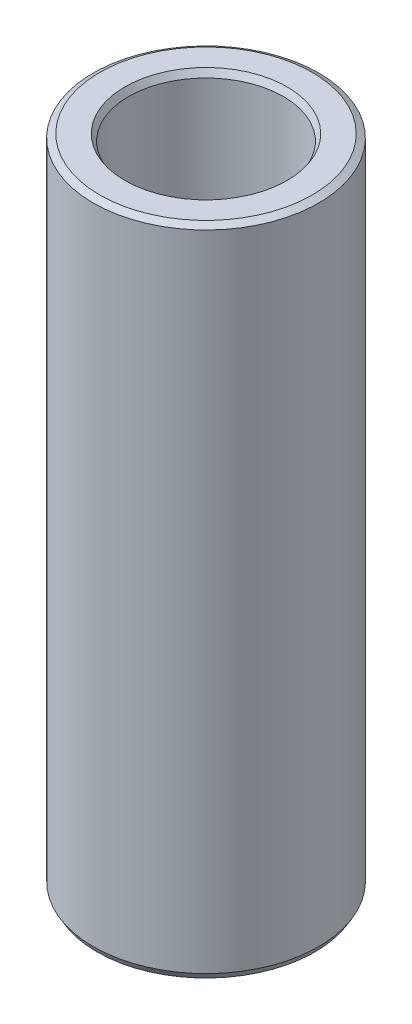
ISO-10303-21;
HEADER;
FILE_DESCRIPTION(('STEP AP214'),'2;1');
FILE_NAME('part.step','',(''),(''),'','','');
FILE_SCHEMA(('AUTOMOTIVE_DESIGN { 1 0 10303 214 1 1 1 1 }'));
ENDSEC;
DATA;
#1=APPLICATION_CONTEXT('core data for automotive mechanical design processes');
#2=APPLICATION_PROTOCOL_DEFINITION('international standard','automotive_design',2000,#1);
#3=PRODUCT_CONTEXT('',#1,'mechanical');
#4=PRODUCT('Part','Part','',(#3));
#5=PRODUCT_RELATED_PRODUCT_CATEGORY('part','',(#4));
#6=PRODUCT_DEFINITION_FORMATION('','',#4);
#7=PRODUCT_DEFINITION_CONTEXT('part definition',#1,'design');
#8=PRODUCT_DEFINITION('design','',#6,#7);
#9=PRODUCT_DEFINITION_SHAPE('','',#8);
#10=(LENGTH_UNIT() NAMED_UNIT(*) SI_UNIT(.MILLI.,.METRE.));
#11=(NAMED_UNIT(*) PLANE_ANGLE_UNIT() SI_UNIT($,.RADIAN.));
#12=(NAMED_UNIT(*) SI_UNIT($,.STERADIAN.) SOLID_ANGLE_UNIT());
#13=UNCERTAINTY_MEASURE_WITH_UNIT(LENGTH_MEASURE(1.E-05),#10,'distance_accuracy_value','');
#14=(GEOMETRIC_REPRESENTATION_CONTEXT(3) GLOBAL_UNCERTAINTY_ASSIGNED_CONTEXT((#13)) GLOBAL_UNIT_ASSIGNED_CONTEXT((#10,
#11,#12)) REPRESENTATION_CONTEXT('',''));
#15=CARTESIAN_POINT('',(0.,0.,0.));
#16=DIRECTION('',(0.,0.,1.));
#17=DIRECTION('',(1.,0.,0.));
#18=AXIS2_PLACEMENT_3D('',#15,#16,#17);
#19=CARTESIAN_POINT('',(0.,43.5333824528574,0.));
#20=DIRECTION('',(0.,-1.,0.));
#21=DIRECTION('',(0.,0.,-1.));
#22=AXIS2_PLACEMENT_3D('',#19,#20,#21);
#23=CYLINDRICAL_SURFACE('',#22,7.5);
#24=CARTESIAN_POINT('',(0.,0.430787770580185,0.));
#25=DIRECTION('',(0.,1.,0.));
#26=DIRECTION('',(0.,0.,1.));
#27=AXIS2_PLACEMENT_3D('',#24,#25,#26);
#28=CIRCLE('',#27,7.5);
#29=CARTESIAN_POINT('',(0.,0.430787770580185,7.5));
#30=VERTEX_POINT('',#29);
#31=EDGE_CURVE('E10',#30,#30,#28,.T.);
#32=ORIENTED_EDGE('',*,*,#31,.T.);
#33=EDGE_LOOP('',(#32));
#34=FACE_BOUND('',#33,.T.);
#35=CARTESIAN_POINT('',(0.,43.2846670175493,0.));
#36=DIRECTION('',(0.,1.,0.));
#37=DIRECTION('',(0.,0.,1.));
#38=AXIS2_PLACEMENT_3D('',#35,#36,#37);
#39=CIRCLE('',#38,7.5);
#40=CARTESIAN_POINT('',(0.,43.2846670175493,7.5));
#41=VERTEX_POINT('',#40);
#42=EDGE_CURVE('E50',#41,#41,#39,.F.);
#43=ORIENTED_EDGE('',*,*,#42,.T.);
#44=EDGE_LOOP('',(#43));
#45=FACE_BOUND('',#44,.T.);
#46=ADVANCED_FACE('F39',(#34,#45),#23,.T.);
#47=CARTESIAN_POINT('',(0.,43.5333824528574,0.));
#48=DIRECTION('',(0.,1.,0.));
#49=DIRECTION('',(0.,0.,1.));
#50=AXIS2_PLACEMENT_3D('',#47,#48,#49);
#51=PLANE('',#50);
#52=CARTESIAN_POINT('',(0.,43.5333824528574,0.));
#53=DIRECTION('',(0.,1.,0.));
#54=DIRECTION('',(0.,0.,1.));
#55=AXIS2_PLACEMENT_3D('',#52,#53,#54);
#56=CIRCLE('',#55,5.39903695434205);
#57=CARTESIAN_POINT('',(0.,43.5333824528574,5.39903695434205));
#58=VERTEX_POINT('',#57);
#59=EDGE_CURVE('E58',#58,#58,#56,.F.);
#60=ORIENTED_EDGE('',*,*,#59,.T.);
#61=EDGE_LOOP('',(#60));
#62=FACE_BOUND('',#61,.T.);
#63=CARTESIAN_POINT('',(0.,43.5333824528574,0.));
#64=DIRECTION('',(0.,1.,0.));
#65=DIRECTION('',(0.,0.,1.));
#66=AXIS2_PLACEMENT_3D('',#63,#64,#65);
#67=CIRCLE('',#66,7.06921222941979);
#68=CARTESIAN_POINT('',(0.,43.5333824528574,7.06921222941979));
#69=VERTEX_POINT('',#68);
#70=EDGE_CURVE('E61',#69,#69,#67,.T.);
#71=ORIENTED_EDGE('',*,*,#70,.T.);
#72=EDGE_LOOP('',(#71));
#73=FACE_BOUND('',#72,.T.);
#74=ADVANCED_FACE('F88',(#62,#73),#51,.T.);
#75=CARTESIAN_POINT('',(0.,0.,0.));
#76=DIRECTION('',(0.,1.,0.));
#77=DIRECTION('',(0.,0.,1.));
#78=AXIS2_PLACEMENT_3D('',#75,#76,#77);
#79=PLANE('',#78);
#80=CARTESIAN_POINT('',(0.,0.,0.));
#81=DIRECTION('',(0.,1.,0.));
#82=DIRECTION('',(0.,0.,1.));
#83=AXIS2_PLACEMENT_3D('',#80,#81,#82);
#84=CIRCLE('',#83,5.58110928961417);
#85=CARTESIAN_POINT('',(0.,0.,5.58110928961417));
#86=VERTEX_POINT('',#85);
#87=EDGE_CURVE('E51',#86,#86,#84,.T.);
#88=ORIENTED_EDGE('',*,*,#87,.T.);
#89=EDGE_LOOP('',(#88));
#90=FACE_BOUND('',#89,.T.);
#91=CARTESIAN_POINT('',(0.,0.,0.));
#92=DIRECTION('',(0.,1.,0.));
#93=DIRECTION('',(0.,0.,1.));
#94=AXIS2_PLACEMENT_3D('',#91,#92,#93);
#95=CIRCLE('',#94,7.25128456469193);
#96=CARTESIAN_POINT('',(0.,0.,7.25128456469193));
#97=VERTEX_POINT('',#96);
#98=EDGE_CURVE('E54',#97,#97,#95,.F.);
#99=ORIENTED_EDGE('',*,*,#98,.T.);
#100=EDGE_LOOP('',(#99));
#101=FACE_BOUND('',#100,.T.);
#102=ADVANCED_FACE('F83',(#90,#101),#79,.F.);
#103=CARTESIAN_POINT('',(0.,43.5333824528574,0.));
#104=DIRECTION('',(0.,-1.,0.));
#105=DIRECTION('',(0.,0.,-1.));
#106=AXIS2_PLACEMENT_3D('',#103,#104,#105);
#107=CYLINDRICAL_SURFACE('',#106,5.15032151903396);
#108=CARTESIAN_POINT('',(0.,43.1025946822772,0.));
#109=DIRECTION('',(0.,1.,0.));
#110=DIRECTION('',(0.,0.,1.));
#111=AXIS2_PLACEMENT_3D('',#108,#109,#110);
#112=CIRCLE('',#111,5.15032151903396);
#113=CARTESIAN_POINT('',(0.,43.1025946822772,5.15032151903396));
#114=VERTEX_POINT('',#113);
#115=EDGE_CURVE('E67',#114,#114,#112,.T.);
#116=ORIENTED_EDGE('',*,*,#115,.T.);
#117=EDGE_LOOP('',(#116));
#118=FACE_BOUND('',#117,.T.);
#119=CARTESIAN_POINT('',(0.,0.248715435308085,0.));
#120=DIRECTION('',(0.,1.,0.));
#121=DIRECTION('',(0.,0.,1.));
#122=AXIS2_PLACEMENT_3D('',#119,#120,#121);
#123=CIRCLE('',#122,5.15032151903396);
#124=CARTESIAN_POINT('',(0.,0.248715435308085,5.15032151903396));
#125=VERTEX_POINT('',#124);
#126=EDGE_CURVE('E69',#125,#125,#123,.F.);
#127=ORIENTED_EDGE('',*,*,#126,.T.);
#128=EDGE_LOOP('',(#127));
#129=FACE_BOUND('',#128,.T.);
#130=ADVANCED_FACE('F71',(#118,#129),#107,.F.);
#131=CARTESIAN_POINT('',(0.,43.1025946822772,0.));
#132=DIRECTION('',(0.,1.,0.));
#133=DIRECTION('',(0.,0.,1.));
#134=AXIS2_PLACEMENT_3D('',#131,#132,#133);
#135=CONICAL_SURFACE('',#134,5.15032151903396,0.523598775598299);
#136=ORIENTED_EDGE('',*,*,#59,.F.);
#137=EDGE_LOOP('',(#136));
#138=FACE_BOUND('',#137,.T.);
#139=ORIENTED_EDGE('',*,*,#115,.F.);
#140=EDGE_LOOP('',(#139));
#141=FACE_BOUND('',#140,.T.);
#142=ADVANCED_FACE('F77',(#138,#141),#135,.F.);
#143=CARTESIAN_POINT('',(0.,0.,0.));
#144=DIRECTION('',(0.,-1.,0.));
#145=DIRECTION('',(0.,0.,-1.));
#146=AXIS2_PLACEMENT_3D('',#143,#144,#145);
#147=CONICAL_SURFACE('',#146,5.58110928961417,1.04719755119659);
#148=ORIENTED_EDGE('',*,*,#126,.F.);
#149=EDGE_LOOP('',(#148));
#150=FACE_BOUND('',#149,.T.);
#151=ORIENTED_EDGE('',*,*,#87,.F.);
#152=EDGE_LOOP('',(#151));
#153=FACE_BOUND('',#152,.T.);
#154=ADVANCED_FACE('F73',(#150,#153),#147,.F.);
#155=CARTESIAN_POINT('',(0.,0.430787770580185,0.));
#156=DIRECTION('',(0.,1.,0.));
#157=DIRECTION('',(0.,0.,1.));
#158=AXIS2_PLACEMENT_3D('',#155,#156,#157);
#159=CONICAL_SURFACE('',#158,7.5,0.523598775598303);
#160=ORIENTED_EDGE('',*,*,#98,.F.);
#161=EDGE_LOOP('',(#160));
#162=FACE_BOUND('',#161,.T.);
#163=ORIENTED_EDGE('',*,*,#31,.F.);
#164=EDGE_LOOP('',(#163));
#165=FACE_BOUND('',#164,.T.);
#166=ADVANCED_FACE('F76',(#162,#165),#159,.T.);
#167=CARTESIAN_POINT('',(0.,43.5333824528574,0.));
#168=DIRECTION('',(0.,-1.,0.));
#169=DIRECTION('',(0.,0.,-1.));
#170=AXIS2_PLACEMENT_3D('',#167,#168,#169);
#171=CONICAL_SURFACE('',#170,7.06921222941979,1.0471975511966);
#172=ORIENTED_EDGE('',*,*,#42,.F.);
#173=EDGE_LOOP('',(#172));
#174=FACE_BOUND('',#173,.T.);
#175=ORIENTED_EDGE('',*,*,#70,.F.);
#176=EDGE_LOOP('',(#175));
#177=FACE_BOUND('',#176,.T.);
#178=ADVANCED_FACE('F45',(#174,#177),#171,.T.);
#179=CLOSED_SHELL('',(#46,#74,#102,#130,#142,#154,#166,#178));
#180=MANIFOLD_SOLID_BREP('B2',#179);
#181=ADVANCED_BREP_SHAPE_REPRESENTATION('',(#18,#180),#14);
#182=SHAPE_DEFINITION_REPRESENTATION(#9,#181);
ENDSEC;
END-ISO-10303-21;
